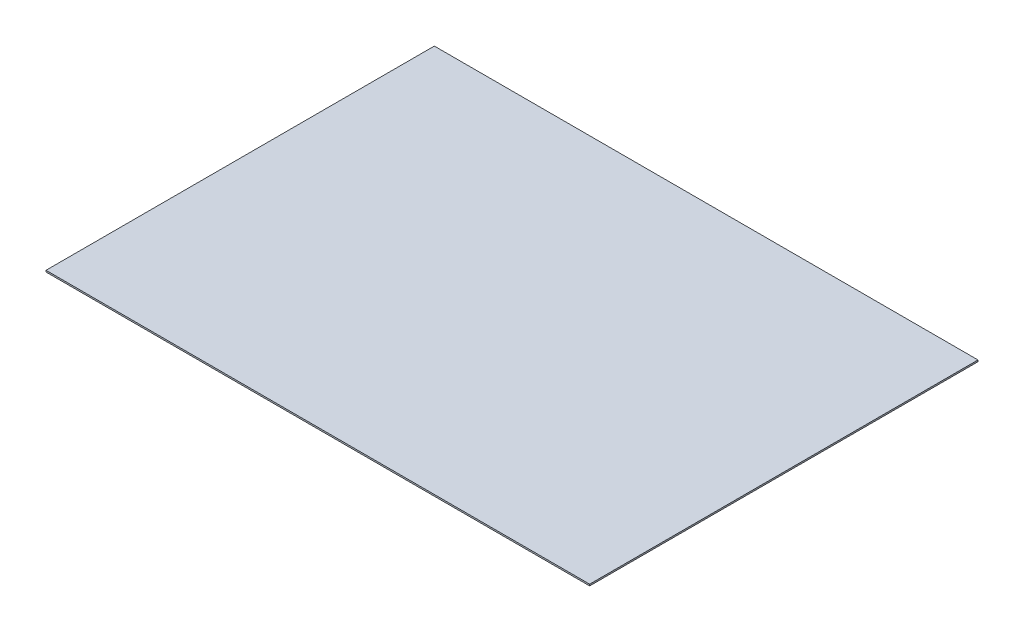
ISO-10303-21;
HEADER;
FILE_DESCRIPTION(('STEP AP214'),'2;1');
FILE_NAME('part.step','',(''),(''),'','','');
FILE_SCHEMA(('AUTOMOTIVE_DESIGN { 1 0 10303 214 1 1 1 1 }'));
ENDSEC;
DATA;
#1=APPLICATION_CONTEXT('core data for automotive mechanical design processes');
#2=APPLICATION_PROTOCOL_DEFINITION('international standard','automotive_design',2000,#1);
#3=PRODUCT_CONTEXT('',#1,'mechanical');
#4=PRODUCT('Part','Part','',(#3));
#5=PRODUCT_RELATED_PRODUCT_CATEGORY('part','',(#4));
#6=PRODUCT_DEFINITION_FORMATION('','',#4);
#7=PRODUCT_DEFINITION_CONTEXT('part definition',#1,'design');
#8=PRODUCT_DEFINITION('design','',#6,#7);
#9=PRODUCT_DEFINITION_SHAPE('','',#8);
#10=(LENGTH_UNIT() NAMED_UNIT(*) SI_UNIT(.MILLI.,.METRE.));
#11=(NAMED_UNIT(*) PLANE_ANGLE_UNIT() SI_UNIT($,.RADIAN.));
#12=(NAMED_UNIT(*) SI_UNIT($,.STERADIAN.) SOLID_ANGLE_UNIT());
#13=UNCERTAINTY_MEASURE_WITH_UNIT(LENGTH_MEASURE(1.E-05),#10,'distance_accuracy_value','');
#14=(GEOMETRIC_REPRESENTATION_CONTEXT(3) GLOBAL_UNCERTAINTY_ASSIGNED_CONTEXT((#13)) GLOBAL_UNIT_ASSIGNED_CONTEXT((#10,
#11,#12)) REPRESENTATION_CONTEXT('',''));
#15=CARTESIAN_POINT('',(0.,0.,0.));
#16=DIRECTION('',(0.,0.,1.));
#17=DIRECTION('',(1.,0.,0.));
#18=AXIS2_PLACEMENT_3D('',#15,#16,#17);
#19=CARTESIAN_POINT('',(-350.,2.,250.));
#20=DIRECTION('',(1.,0.,0.));
#21=DIRECTION('',(0.,0.,-1.));
#22=AXIS2_PLACEMENT_3D('',#19,#20,#21);
#23=PLANE('',#22);
#24=DIRECTION('',(0.,0.,1.));
#25=VECTOR('',#24,1.);
#26=CARTESIAN_POINT('',(-350.,0.,250.));
#27=LINE('',#26,#25);
#28=CARTESIAN_POINT('',(-350.,0.,-250.));
#29=VERTEX_POINT('',#28);
#30=CARTESIAN_POINT('',(-350.,0.,250.));
#31=VERTEX_POINT('',#30);
#32=EDGE_CURVE('E96',#29,#31,#27,.T.);
#33=ORIENTED_EDGE('',*,*,#32,.T.);
#34=DIRECTION('',(0.,-1.,0.));
#35=VECTOR('',#34,1.);
#36=CARTESIAN_POINT('',(-350.,2.,250.));
#37=LINE('',#36,#35);
#38=CARTESIAN_POINT('',(-350.,2.,250.));
#39=VERTEX_POINT('',#38);
#40=EDGE_CURVE('E11',#39,#31,#37,.T.);
#41=ORIENTED_EDGE('',*,*,#40,.F.);
#42=DIRECTION('',(0.,0.,1.));
#43=VECTOR('',#42,1.);
#44=CARTESIAN_POINT('',(-350.,2.,250.));
#45=LINE('',#44,#43);
#46=CARTESIAN_POINT('',(-350.,2.,-250.));
#47=VERTEX_POINT('',#46);
#48=EDGE_CURVE('E84',#47,#39,#45,.T.);
#49=ORIENTED_EDGE('',*,*,#48,.F.);
#50=DIRECTION('',(0.,-1.,0.));
#51=VECTOR('',#50,1.);
#52=CARTESIAN_POINT('',(-350.,2.,-250.));
#53=LINE('',#52,#51);
#54=EDGE_CURVE('E92',#47,#29,#53,.T.);
#55=ORIENTED_EDGE('',*,*,#54,.T.);
#56=EDGE_LOOP('',(#33,#41,#49,#55));
#57=FACE_BOUND('',#56,.T.);
#58=ADVANCED_FACE('F33',(#57),#23,.F.);
#59=CARTESIAN_POINT('',(350.,2.,250.));
#60=DIRECTION('',(0.,0.,-1.));
#61=DIRECTION('',(-1.,0.,0.));
#62=AXIS2_PLACEMENT_3D('',#59,#60,#61);
#63=PLANE('',#62);
#64=DIRECTION('',(1.,0.,0.));
#65=VECTOR('',#64,1.);
#66=CARTESIAN_POINT('',(350.,0.,250.));
#67=LINE('',#66,#65);
#68=CARTESIAN_POINT('',(350.,0.,250.));
#69=VERTEX_POINT('',#68);
#70=EDGE_CURVE('E88',#31,#69,#67,.T.);
#71=ORIENTED_EDGE('',*,*,#70,.T.);
#72=DIRECTION('',(0.,-1.,0.));
#73=VECTOR('',#72,1.);
#74=CARTESIAN_POINT('',(350.,2.,250.));
#75=LINE('',#74,#73);
#76=CARTESIAN_POINT('',(350.,2.,250.));
#77=VERTEX_POINT('',#76);
#78=EDGE_CURVE('E41',#77,#69,#75,.T.);
#79=ORIENTED_EDGE('',*,*,#78,.F.);
#80=DIRECTION('',(1.,0.,0.));
#81=VECTOR('',#80,1.);
#82=CARTESIAN_POINT('',(350.,2.,250.));
#83=LINE('',#82,#81);
#84=EDGE_CURVE('E79',#39,#77,#83,.T.);
#85=ORIENTED_EDGE('',*,*,#84,.F.);
#86=ORIENTED_EDGE('',*,*,#40,.T.);
#87=EDGE_LOOP('',(#71,#79,#85,#86));
#88=FACE_BOUND('',#87,.T.);
#89=ADVANCED_FACE('F87',(#88),#63,.F.);
#90=CARTESIAN_POINT('',(350.,2.,250.));
#91=DIRECTION('',(-1.,0.,0.));
#92=DIRECTION('',(0.,0.,1.));
#93=AXIS2_PLACEMENT_3D('',#90,#91,#92);
#94=PLANE('',#93);
#95=DIRECTION('',(0.,0.,-1.));
#96=VECTOR('',#95,1.);
#97=CARTESIAN_POINT('',(350.,0.,250.));
#98=LINE('',#97,#96);
#99=CARTESIAN_POINT('',(350.,0.,-250.));
#100=VERTEX_POINT('',#99);
#101=EDGE_CURVE('E66',#69,#100,#98,.T.);
#102=ORIENTED_EDGE('',*,*,#101,.T.);
#103=DIRECTION('',(0.,-1.,0.));
#104=VECTOR('',#103,1.);
#105=CARTESIAN_POINT('',(350.,2.,-250.));
#106=LINE('',#105,#104);
#107=CARTESIAN_POINT('',(350.,2.,-250.));
#108=VERTEX_POINT('',#107);
#109=EDGE_CURVE('E89',#108,#100,#106,.T.);
#110=ORIENTED_EDGE('',*,*,#109,.F.);
#111=DIRECTION('',(0.,0.,-1.));
#112=VECTOR('',#111,1.);
#113=CARTESIAN_POINT('',(350.,2.,250.));
#114=LINE('',#113,#112);
#115=EDGE_CURVE('E82',#77,#108,#114,.T.);
#116=ORIENTED_EDGE('',*,*,#115,.F.);
#117=ORIENTED_EDGE('',*,*,#78,.T.);
#118=EDGE_LOOP('',(#102,#110,#116,#117));
#119=FACE_BOUND('',#118,.T.);
#120=ADVANCED_FACE('F90',(#119),#94,.F.);
#121=CARTESIAN_POINT('',(350.,2.,-250.));
#122=DIRECTION('',(0.,0.,1.));
#123=DIRECTION('',(1.,0.,0.));
#124=AXIS2_PLACEMENT_3D('',#121,#122,#123);
#125=PLANE('',#124);
#126=DIRECTION('',(-1.,0.,0.));
#127=VECTOR('',#126,1.);
#128=CARTESIAN_POINT('',(350.,0.,-250.));
#129=LINE('',#128,#127);
#130=EDGE_CURVE('E72',#100,#29,#129,.T.);
#131=ORIENTED_EDGE('',*,*,#130,.T.);
#132=ORIENTED_EDGE('',*,*,#54,.F.);
#133=DIRECTION('',(-1.,0.,0.));
#134=VECTOR('',#133,1.);
#135=CARTESIAN_POINT('',(350.,2.,-250.));
#136=LINE('',#135,#134);
#137=EDGE_CURVE('E49',#108,#47,#136,.T.);
#138=ORIENTED_EDGE('',*,*,#137,.F.);
#139=ORIENTED_EDGE('',*,*,#109,.T.);
#140=EDGE_LOOP('',(#131,#132,#138,#139));
#141=FACE_BOUND('',#140,.T.);
#142=ADVANCED_FACE('F103',(#141),#125,.F.);
#143=CARTESIAN_POINT('',(0.,2.,0.));
#144=DIRECTION('',(0.,1.,0.));
#145=DIRECTION('',(0.,0.,1.));
#146=AXIS2_PLACEMENT_3D('',#143,#144,#145);
#147=PLANE('',#146);
#148=ORIENTED_EDGE('',*,*,#48,.T.);
#149=ORIENTED_EDGE('',*,*,#84,.T.);
#150=ORIENTED_EDGE('',*,*,#115,.T.);
#151=ORIENTED_EDGE('',*,*,#137,.T.);
#152=EDGE_LOOP('',(#148,#149,#150,#151));
#153=FACE_BOUND('',#152,.T.);
#154=ADVANCED_FACE('F80',(#153),#147,.T.);
#155=CARTESIAN_POINT('',(0.,0.,0.));
#156=DIRECTION('',(0.,1.,0.));
#157=DIRECTION('',(0.,0.,1.));
#158=AXIS2_PLACEMENT_3D('',#155,#156,#157);
#159=PLANE('',#158);
#160=ORIENTED_EDGE('',*,*,#32,.F.);
#161=ORIENTED_EDGE('',*,*,#130,.F.);
#162=ORIENTED_EDGE('',*,*,#101,.F.);
#163=ORIENTED_EDGE('',*,*,#70,.F.);
#164=EDGE_LOOP('',(#160,#161,#162,#163));
#165=FACE_BOUND('',#164,.T.);
#166=ADVANCED_FACE('F106',(#165),#159,.F.);
#167=CLOSED_SHELL('',(#58,#89,#120,#142,#154,#166));
#168=MANIFOLD_SOLID_BREP('B2',#167);
#169=ADVANCED_BREP_SHAPE_REPRESENTATION('',(#18,#168),#14);
#170=SHAPE_DEFINITION_REPRESENTATION(#9,#169);
ENDSEC;
END-ISO-10303-21;
